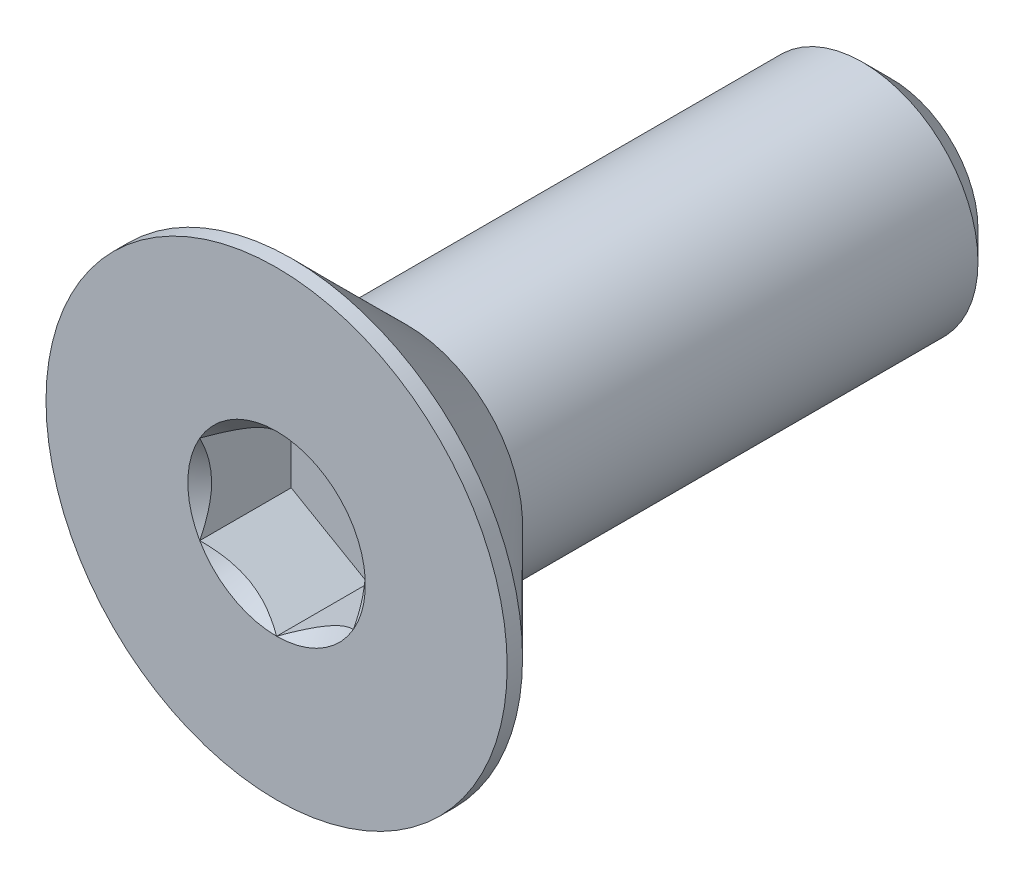
ISO-10303-21;
HEADER;
FILE_DESCRIPTION(('STEP AP214'),'2;1');
FILE_NAME('part.step','',(''),(''),'','','');
FILE_SCHEMA(('AUTOMOTIVE_DESIGN { 1 0 10303 214 1 1 1 1 }'));
ENDSEC;
DATA;
#1=APPLICATION_CONTEXT('core data for automotive mechanical design processes');
#2=APPLICATION_PROTOCOL_DEFINITION('international standard','automotive_design',2000,#1);
#3=PRODUCT_CONTEXT('',#1,'mechanical');
#4=PRODUCT('Part','Part','',(#3));
#5=PRODUCT_RELATED_PRODUCT_CATEGORY('part','',(#4));
#6=PRODUCT_DEFINITION_FORMATION('','',#4);
#7=PRODUCT_DEFINITION_CONTEXT('part definition',#1,'design');
#8=PRODUCT_DEFINITION('design','',#6,#7);
#9=PRODUCT_DEFINITION_SHAPE('','',#8);
#10=(LENGTH_UNIT() NAMED_UNIT(*) SI_UNIT(.MILLI.,.METRE.));
#11=(NAMED_UNIT(*) PLANE_ANGLE_UNIT() SI_UNIT($,.RADIAN.));
#12=(NAMED_UNIT(*) SI_UNIT($,.STERADIAN.) SOLID_ANGLE_UNIT());
#13=UNCERTAINTY_MEASURE_WITH_UNIT(LENGTH_MEASURE(1.E-05),#10,'distance_accuracy_value','');
#14=(GEOMETRIC_REPRESENTATION_CONTEXT(3) GLOBAL_UNCERTAINTY_ASSIGNED_CONTEXT((#13)) GLOBAL_UNIT_ASSIGNED_CONTEXT((#10,
#11,#12)) REPRESENTATION_CONTEXT('',''));
#15=CARTESIAN_POINT('',(0.,0.,0.));
#16=DIRECTION('',(0.,0.,1.));
#17=DIRECTION('',(1.,0.,0.));
#18=AXIS2_PLACEMENT_3D('',#15,#16,#17);
#19=CARTESIAN_POINT('',(1.,-0.577350269189626,-1.19));
#20=DIRECTION('',(0.,0.,1.));
#21=DIRECTION('',(1.,0.,0.));
#22=AXIS2_PLACEMENT_3D('',#19,#20,#21);
#23=PLANE('',#22);
#24=DIRECTION('',(0.,1.,0.));
#25=VECTOR('',#24,1.);
#26=CARTESIAN_POINT('',(-1.,0.577350269189626,-1.19));
#27=LINE('',#26,#25);
#28=CARTESIAN_POINT('',(-0.999999999999999,0.577350269189625,-1.19));
#29=VERTEX_POINT('',#28);
#30=CARTESIAN_POINT('',(-1.,-0.577350269189626,-1.19));
#31=VERTEX_POINT('',#30);
#32=EDGE_CURVE('E83',#29,#31,#27,.F.);
#33=ORIENTED_EDGE('',*,*,#32,.T.);
#34=DIRECTION('',(0.866025403784439,-0.5,0.));
#35=VECTOR('',#34,1.);
#36=CARTESIAN_POINT('',(-1.,-0.577350269189626,-1.19));
#37=LINE('',#36,#35);
#38=CARTESIAN_POINT('',(0.,-1.15470053837925,-1.19));
#39=VERTEX_POINT('',#38);
#40=EDGE_CURVE('E85',#31,#39,#37,.T.);
#41=ORIENTED_EDGE('',*,*,#40,.T.);
#42=DIRECTION('',(0.866025403784439,0.5,0.));
#43=VECTOR('',#42,1.);
#44=CARTESIAN_POINT('',(0.,-1.15470053837925,-1.19));
#45=LINE('',#44,#43);
#46=CARTESIAN_POINT('',(1.,-0.577350269189626,-1.19));
#47=VERTEX_POINT('',#46);
#48=EDGE_CURVE('E86',#39,#47,#45,.T.);
#49=ORIENTED_EDGE('',*,*,#48,.T.);
#50=DIRECTION('',(0.,1.,0.));
#51=VECTOR('',#50,1.);
#52=CARTESIAN_POINT('',(1.,-0.577350269189626,-1.19));
#53=LINE('',#52,#51);
#54=CARTESIAN_POINT('',(1.,0.577350269189626,-1.19));
#55=VERTEX_POINT('',#54);
#56=EDGE_CURVE('E72',#47,#55,#53,.T.);
#57=ORIENTED_EDGE('',*,*,#56,.T.);
#58=DIRECTION('',(-0.866025403784439,0.5,0.));
#59=VECTOR('',#58,1.);
#60=CARTESIAN_POINT('',(1.,0.577350269189626,-1.19));
#61=LINE('',#60,#59);
#62=CARTESIAN_POINT('',(0.,1.15470053837925,-1.19));
#63=VERTEX_POINT('',#62);
#64=EDGE_CURVE('E111',#55,#63,#61,.T.);
#65=ORIENTED_EDGE('',*,*,#64,.T.);
#66=DIRECTION('',(-0.866025403784439,-0.5,0.));
#67=VECTOR('',#66,1.);
#68=CARTESIAN_POINT('',(0.,1.15470053837925,-1.19));
#69=LINE('',#68,#67);
#70=EDGE_CURVE('E116',#63,#29,#69,.T.);
#71=ORIENTED_EDGE('',*,*,#70,.T.);
#72=EDGE_LOOP('',(#33,#41,#49,#57,#65,#71));
#73=FACE_BOUND('',#72,.T.);
#74=ADVANCED_FACE('F17',(#73),#23,.T.);
#75=CARTESIAN_POINT('',(0.,-1.15470053837925,-1.19));
#76=DIRECTION('',(0.5,-0.866025403784439,0.));
#77=DIRECTION('',(0.866025403784439,0.5,0.));
#78=AXIS2_PLACEMENT_3D('',#75,#76,#77);
#79=PLANE('',#78);
#80=CARTESIAN_POINT('',(-3.93149211717141E-11,-1.15470053837926,-9.98108720890825E-11));
#81=CARTESIAN_POINT('',(0.0343705355201057,-1.13485670043636,-0.0198247004221409));
#82=CARTESIAN_POINT('',(0.0693156756519455,-1.11468111438035,-0.0384849664872145));
#83=CARTESIAN_POINT('',(0.140572403035621,-1.07354102364821,-0.0726511232407904));
#84=CARTESIAN_POINT('',(0.176890763106012,-1.05257260868342,-0.0881380101422932));
#85=CARTESIAN_POINT('',(0.250125097696327,-1.01029074589262,-0.11466695978462));
#86=CARTESIAN_POINT('',(0.287022429458596,-0.988988061467716,-0.125775687570534));
#87=CARTESIAN_POINT('',(0.361628600499482,-0.945914168534359,-0.142891513233382));
#88=CARTESIAN_POINT('',(0.399335163701569,-0.924144274119301,-0.148911380305544));
#89=CARTESIAN_POINT('',(0.464327716043936,-0.886620806529054,-0.154341115390247));
#90=CARTESIAN_POINT('',(0.491529304810035,-0.87091596193258,-0.155143433217331));
#91=CARTESIAN_POINT('',(0.545879708710831,-0.839536741609904,-0.153791220399352));
#92=CARTESIAN_POINT('',(0.573028510861522,-0.823862373380022,-0.151636036594819));
#93=CARTESIAN_POINT('',(0.654087027893978,-0.777063216751215,-0.140876680449878));
#94=CARTESIAN_POINT('',(0.707593237347495,-0.746171392319914,-0.127977491939688));
#95=CARTESIAN_POINT('',(0.801462739355952,-0.691975810066637,-0.0968623195341799));
#96=CARTESIAN_POINT('',(0.842267871071583,-0.668416956286299,-0.080283012402365));
#97=CARTESIAN_POINT('',(0.922281198810023,-0.622221239977752,-0.042938715152404));
#98=CARTESIAN_POINT('',(0.961494106307927,-0.599581657278129,-0.0221873504710734));
#99=CARTESIAN_POINT('',(1.00000000003183,-0.577350269171246,-1.09229235933159E-10));
#100=B_SPLINE_CURVE_WITH_KNOTS('',3,(#80,#81,#82,#83,#84,#85,#86,#87,#88,#89,#90,#91,#92,#93,
#94,#95,#96,#97,#98,#99),.UNSPECIFIED.,.F.,.F.,(4,2,2,2,2,2,2,2,2,4),(0.,0.133182946587487,
0.267141541479662,0.398973326833972,0.530473323727982,0.624596460473079,0.718740387507005,
0.907081600610891,1.05673041335255,1.20589820631879),.UNSPECIFIED.);
#101=CARTESIAN_POINT('',(0.,-1.15470053839843,-1.08428119008629E-10));
#102=VERTEX_POINT('',#101);
#103=CARTESIAN_POINT('',(1.00000000001661,-0.577350269199215,-1.08427881602401E-10));
#104=VERTEX_POINT('',#103);
#105=EDGE_CURVE('E20',#102,#104,#100,.T.);
#106=ORIENTED_EDGE('',*,*,#105,.T.);
#107=DIRECTION('',(0.,0.,-1.));
#108=VECTOR('',#107,1.);
#109=CARTESIAN_POINT('',(1.,-0.577350269189626,-1.19));
#110=LINE('',#109,#108);
#111=EDGE_CURVE('E91',#104,#47,#110,.T.);
#112=ORIENTED_EDGE('',*,*,#111,.T.);
#113=ORIENTED_EDGE('',*,*,#48,.F.);
#114=DIRECTION('',(0.,0.,1.));
#115=VECTOR('',#114,1.);
#116=CARTESIAN_POINT('',(0.,-1.15470053837925,-1.19));
#117=LINE('',#116,#115);
#118=EDGE_CURVE('E59',#39,#102,#117,.T.);
#119=ORIENTED_EDGE('',*,*,#118,.T.);
#120=EDGE_LOOP('',(#106,#112,#113,#119));
#121=FACE_BOUND('',#120,.T.);
#122=ADVANCED_FACE('F90',(#121),#79,.F.);
#123=CARTESIAN_POINT('',(-1.,-0.577350269189626,-1.19));
#124=DIRECTION('',(-0.5,-0.866025403784439,0.));
#125=DIRECTION('',(0.866025403784439,-0.5,0.));
#126=AXIS2_PLACEMENT_3D('',#123,#124,#125);
#127=PLANE('',#126);
#128=CARTESIAN_POINT('',(-1.00000000001966,-0.577350269155583,-9.98096224744557E-11));
#129=CARTESIAN_POINT('',(-0.965629464472823,-0.597194107120269,-0.0198247004221396));
#130=CARTESIAN_POINT('',(-0.930684324346155,-0.617369693185242,-0.0384849664872131));
#131=CARTESIAN_POINT('',(-0.859427596966287,-0.658509783923978,-0.0726511232407891));
#132=CARTESIAN_POINT('',(-0.823109236894494,-0.679478198886334,-0.0881380101422919));
#133=CARTESIAN_POINT('',(-0.749874902303172,-0.721760061675394,-0.114666959784619));
#134=CARTESIAN_POINT('',(-0.71297757054127,-0.743062746100931,-0.125775687570532));
#135=CARTESIAN_POINT('',(-0.638371399500649,-0.786136639034746,-0.14289151323338));
#136=CARTESIAN_POINT('',(-0.600664836298461,-0.807906533449627,-0.148911380305542));
#137=CARTESIAN_POINT('',(-0.535672283956042,-0.845430001039785,-0.154341115390246));
#138=CARTESIAN_POINT('',(-0.508470695189959,-0.861134845636286,-0.155143433217329));
#139=CARTESIAN_POINT('',(-0.454120291289175,-0.892514065958982,-0.15379122039935));
#140=CARTESIAN_POINT('',(-0.426971489138479,-0.908188434188858,-0.151636036594817));
#141=CARTESIAN_POINT('',(-0.345912972106017,-0.954987590817655,-0.140876680449876));
#142=CARTESIAN_POINT('',(-0.292406762652503,-0.985879415248961,-0.127977491939686));
#143=CARTESIAN_POINT('',(-0.198537260644048,-1.04007499750224,-0.0968623195341786));
#144=CARTESIAN_POINT('',(-0.157732128928417,-1.06363385128258,-0.0802830124023638));
#145=CARTESIAN_POINT('',(-0.0777188011899764,-1.10982956759112,-0.0429387151524029));
#146=CARTESIAN_POINT('',(-0.0385058936920724,-1.13246915029075,-0.0221873504710723));
#147=CARTESIAN_POINT('',(3.18328951443562E-11,-1.15470053839763,-1.09228385770901E-10));
#148=B_SPLINE_CURVE_WITH_KNOTS('',3,(#128,#129,#130,#131,#132,#133,#134,#135,#136,#137,#138,
#139,#140,#141,#142,#143,#144,#145,#146,#147),.UNSPECIFIED.,.F.,.F.,(4,2,2,2,2,2,2,2,2,4),(0.,
0.133182946587487,0.267141541479662,0.398973326833972,0.530473323727981,0.624596460473079,
0.718740387507004,0.907081600610891,1.05673041335255,1.20589820631879),.UNSPECIFIED.);
#149=CARTESIAN_POINT('',(-1.00000000001661,-0.577350269199216,-1.08427372625039E-10));
#150=VERTEX_POINT('',#149);
#151=EDGE_CURVE('E95',#150,#102,#148,.T.);
#152=ORIENTED_EDGE('',*,*,#151,.T.);
#153=ORIENTED_EDGE('',*,*,#118,.F.);
#154=ORIENTED_EDGE('',*,*,#40,.F.);
#155=DIRECTION('',(0.,0.,1.));
#156=VECTOR('',#155,1.);
#157=CARTESIAN_POINT('',(-1.,-0.577350269189626,-1.19));
#158=LINE('',#157,#156);
#159=EDGE_CURVE('E97',#31,#150,#158,.T.);
#160=ORIENTED_EDGE('',*,*,#159,.T.);
#161=EDGE_LOOP('',(#152,#153,#154,#160));
#162=FACE_BOUND('',#161,.T.);
#163=ADVANCED_FACE('F93',(#162),#127,.F.);
#164=CARTESIAN_POINT('',(-1.,0.577350269189626,-1.19));
#165=DIRECTION('',(-1.,0.,0.));
#166=DIRECTION('',(0.,0.,1.));
#167=AXIS2_PLACEMENT_3D('',#164,#165,#166);
#168=PLANE('',#167);
#169=CARTESIAN_POINT('',(-0.999999999980349,0.577350269223676,-9.98097322622048E-11));
#170=CARTESIAN_POINT('',(-0.999999999992929,0.537662593316093,-0.0198247004221396));
#171=CARTESIAN_POINT('',(-0.999999999998101,0.497311421195105,-0.0384849664872131));
#172=CARTESIAN_POINT('',(-1.00000000000191,0.41503123972423,-0.0726511232407892));
#173=CARTESIAN_POINT('',(-1.00000000000051,0.373094409797089,-0.0881380101422921));
#174=CARTESIAN_POINT('',(-0.999999999999501,0.288530684217224,-0.114666959784619));
#175=CARTESIAN_POINT('',(-0.999999999999868,0.245925315366786,-0.125775687570532));
#176=CARTESIAN_POINT('',(-1.00000000000013,0.159777529499614,-0.142891513233381));
#177=CARTESIAN_POINT('',(-1.00000000000003,0.116237740669674,-0.148911380305542));
#178=CARTESIAN_POINT('',(-0.999999999999979,0.0411908054892712,-0.154341115390246));
#179=CARTESIAN_POINT('',(-0.999999999999994,0.00978111629629506,-0.155143433217329));
#180=CARTESIAN_POINT('',(-1.00000000000001,-0.0529773243490767,-0.15379122039935));
#181=CARTESIAN_POINT('',(-1.,-0.0843260608088347,-0.151636036594817));
#182=CARTESIAN_POINT('',(-0.999999999999996,-0.177924374066439,-0.140876680449876));
#183=CARTESIAN_POINT('',(-0.999999999999999,-0.239708022929046,-0.127977491939686));
#184=CARTESIAN_POINT('',(-1.,-0.348099187435602,-0.0968623195341786));
#185=CARTESIAN_POINT('',(-1.,-0.395216894996278,-0.0802830124023637));
#186=CARTESIAN_POINT('',(-1.,-0.48760832761337,-0.0429387151524027));
#187=CARTESIAN_POINT('',(-0.999999999999999,-0.532887493012616,-0.0221873504710721));
#188=CARTESIAN_POINT('',(-1.,-0.577350269226384,-1.09228152961273E-10));
#189=B_SPLINE_CURVE_WITH_KNOTS('',3,(#169,#170,#171,#172,#173,#174,#175,#176,#177,#178,#179,
#180,#181,#182,#183,#184,#185,#186,#187,#188),.UNSPECIFIED.,.F.,.F.,(4,2,2,2,2,2,2,2,2,4),(0.,
0.133182946587487,0.267141541479662,0.398973326833972,0.530473323727981,0.624596460473079,
0.718740387507004,0.907081600610891,1.05673041335255,1.20589820631879),.UNSPECIFIED.);
#190=CARTESIAN_POINT('',(-1.00000000001661,0.577350269199215,-1.08428018983097E-10));
#191=VERTEX_POINT('',#190);
#192=EDGE_CURVE('E195',#191,#150,#189,.T.);
#193=ORIENTED_EDGE('',*,*,#192,.T.);
#194=ORIENTED_EDGE('',*,*,#159,.F.);
#195=ORIENTED_EDGE('',*,*,#32,.F.);
#196=DIRECTION('',(0.,0.,1.));
#197=VECTOR('',#196,1.);
#198=CARTESIAN_POINT('',(-0.999999999999999,0.577350269189625,-1.19));
#199=LINE('',#198,#197);
#200=EDGE_CURVE('E113',#29,#191,#199,.T.);
#201=ORIENTED_EDGE('',*,*,#200,.T.);
#202=EDGE_LOOP('',(#193,#194,#195,#201));
#203=FACE_BOUND('',#202,.T.);
#204=ADVANCED_FACE('F205',(#203),#168,.F.);
#205=CARTESIAN_POINT('',(0.,1.15470053837925,-1.19));
#206=DIRECTION('',(-0.5,0.866025403784439,0.));
#207=DIRECTION('',(-0.866025403784439,-0.5,0.));
#208=AXIS2_PLACEMENT_3D('',#205,#206,#207);
#209=PLANE('',#208);
#210=CARTESIAN_POINT('',(3.93151612738882E-11,1.15470053837926,-9.98107731299659E-11));
#211=CARTESIAN_POINT('',(-0.0343705355201053,1.13485670043636,-0.0198247004221408));
#212=CARTESIAN_POINT('',(-0.0693156756519452,1.11468111438035,-0.0384849664872144));
#213=CARTESIAN_POINT('',(-0.140572403035621,1.07354102364821,-0.0726511232407903));
#214=CARTESIAN_POINT('',(-0.176890763106012,1.05257260868342,-0.0881380101422931));
#215=CARTESIAN_POINT('',(-0.250125097696327,1.01029074589262,-0.11466695978462));
#216=CARTESIAN_POINT('',(-0.287022429458596,0.988988061467716,-0.125775687570534));
#217=CARTESIAN_POINT('',(-0.361628600499482,0.945914168534359,-0.142891513233382));
#218=CARTESIAN_POINT('',(-0.399335163701568,0.924144274119301,-0.148911380305543));
#219=CARTESIAN_POINT('',(-0.464327716043936,0.886620806529055,-0.154341115390247));
#220=CARTESIAN_POINT('',(-0.491529304810035,0.87091596193258,-0.155143433217331));
#221=CARTESIAN_POINT('',(-0.54587970871083,0.839536741609904,-0.153791220399352));
#222=CARTESIAN_POINT('',(-0.573028510861522,0.823862373380022,-0.151636036594819));
#223=CARTESIAN_POINT('',(-0.654087027893978,0.777063216751215,-0.140876680449878));
#224=CARTESIAN_POINT('',(-0.707593237347495,0.746171392319914,-0.127977491939688));
#225=CARTESIAN_POINT('',(-0.801462739355952,0.691975810066637,-0.0968623195341798));
#226=CARTESIAN_POINT('',(-0.842267871071583,0.668416956286299,-0.0802830124023649));
#227=CARTESIAN_POINT('',(-0.922281198810023,0.622221239977752,-0.0429387151524038));
#228=CARTESIAN_POINT('',(-0.961494106307926,0.599581657278129,-0.0221873504710732));
#229=CARTESIAN_POINT('',(-1.00000000003183,0.577350269171245,-1.09229129721644E-10));
#230=B_SPLINE_CURVE_WITH_KNOTS('',3,(#210,#211,#212,#213,#214,#215,#216,#217,#218,#219,#220,
#221,#222,#223,#224,#225,#226,#227,#228,#229),.UNSPECIFIED.,.F.,.F.,(4,2,2,2,2,2,2,2,2,4),(0.,
0.133182946587487,0.267141541479662,0.398973326833972,0.530473323727982,0.624596460473079,
0.718740387507005,0.907081600610891,1.05673041335255,1.20589820631879),.UNSPECIFIED.);
#231=CARTESIAN_POINT('',(0.,1.15470053839843,-1.08428126061562E-10));
#232=VERTEX_POINT('',#231);
#233=EDGE_CURVE('E187',#232,#191,#230,.T.);
#234=ORIENTED_EDGE('',*,*,#233,.T.);
#235=ORIENTED_EDGE('',*,*,#200,.F.);
#236=ORIENTED_EDGE('',*,*,#70,.F.);
#237=DIRECTION('',(0.,0.,1.));
#238=VECTOR('',#237,1.);
#239=CARTESIAN_POINT('',(0.,1.15470053837925,-1.19));
#240=LINE('',#239,#238);
#241=EDGE_CURVE('E108',#63,#232,#240,.T.);
#242=ORIENTED_EDGE('',*,*,#241,.T.);
#243=EDGE_LOOP('',(#234,#235,#236,#242));
#244=FACE_BOUND('',#243,.T.);
#245=ADVANCED_FACE('F201',(#244),#209,.F.);
#246=CARTESIAN_POINT('',(1.,0.577350269189626,-1.19));
#247=DIRECTION('',(0.5,0.866025403784439,0.));
#248=DIRECTION('',(-0.866025403784439,0.5,0.));
#249=AXIS2_PLACEMENT_3D('',#246,#247,#248);
#250=PLANE('',#249);
#251=CARTESIAN_POINT('',(1.00000000001966,0.577350269155583,-9.98095479908323E-11));
#252=CARTESIAN_POINT('',(0.965629464472823,0.597194107120269,-0.0198247004221397));
#253=CARTESIAN_POINT('',(0.930684324346155,0.617369693185242,-0.0384849664872132));
#254=CARTESIAN_POINT('',(0.859427596966287,0.658509783923978,-0.0726511232407891));
#255=CARTESIAN_POINT('',(0.823109236894494,0.679478198886334,-0.0881380101422918));
#256=CARTESIAN_POINT('',(0.749874902303172,0.721760061675394,-0.114666959784619));
#257=CARTESIAN_POINT('',(0.712977570541271,0.743062746100931,-0.125775687570532));
#258=CARTESIAN_POINT('',(0.638371399500649,0.786136639034746,-0.142891513233381));
#259=CARTESIAN_POINT('',(0.600664836298461,0.807906533449627,-0.148911380305542));
#260=CARTESIAN_POINT('',(0.535672283956042,0.845430001039784,-0.154341115390246));
#261=CARTESIAN_POINT('',(0.508470695189959,0.861134845636286,-0.155143433217329));
#262=CARTESIAN_POINT('',(0.454120291289175,0.892514065958982,-0.15379122039935));
#263=CARTESIAN_POINT('',(0.426971489138479,0.908188434188858,-0.151636036594817));
#264=CARTESIAN_POINT('',(0.345912972106017,0.954987590817654,-0.140876680449876));
#265=CARTESIAN_POINT('',(0.292406762652503,0.985879415248961,-0.127977491939686));
#266=CARTESIAN_POINT('',(0.198537260644048,1.04007499750224,-0.0968623195341785));
#267=CARTESIAN_POINT('',(0.157732128928417,1.06363385128258,-0.0802830124023638));
#268=CARTESIAN_POINT('',(0.0777188011899766,1.10982956759112,-0.042938715152403));
#269=CARTESIAN_POINT('',(0.0385058936920726,1.13246915029075,-0.0221873504710725));
#270=CARTESIAN_POINT('',(-3.18326351011692E-11,1.15470053839763,-1.0922858632033E-10));
#271=B_SPLINE_CURVE_WITH_KNOTS('',3,(#251,#252,#253,#254,#255,#256,#257,#258,#259,#260,#261,
#262,#263,#264,#265,#266,#267,#268,#269,#270),.UNSPECIFIED.,.F.,.F.,(4,2,2,2,2,2,2,2,2,4),(0.,
0.133182946587487,0.267141541479662,0.398973326833972,0.530473323727981,0.624596460473079,
0.718740387507004,0.907081600610891,1.05673041335255,1.20589820631879),.UNSPECIFIED.);
#272=CARTESIAN_POINT('',(1.00000000001661,0.577350269199216,-1.08427368067908E-10));
#273=VERTEX_POINT('',#272);
#274=EDGE_CURVE('E157',#273,#232,#271,.T.);
#275=ORIENTED_EDGE('',*,*,#274,.T.);
#276=ORIENTED_EDGE('',*,*,#241,.F.);
#277=ORIENTED_EDGE('',*,*,#64,.F.);
#278=DIRECTION('',(0.,0.,-1.));
#279=VECTOR('',#278,1.);
#280=CARTESIAN_POINT('',(1.,0.577350269189626,-1.19));
#281=LINE('',#280,#279);
#282=EDGE_CURVE('E40',#55,#273,#281,.F.);
#283=ORIENTED_EDGE('',*,*,#282,.T.);
#284=EDGE_LOOP('',(#275,#276,#277,#283));
#285=FACE_BOUND('',#284,.T.);
#286=ADVANCED_FACE('F204',(#285),#250,.F.);
#287=CARTESIAN_POINT('',(1.,-0.577350269189626,-1.19));
#288=DIRECTION('',(1.,0.,0.));
#289=DIRECTION('',(0.,0.,-1.));
#290=AXIS2_PLACEMENT_3D('',#287,#288,#289);
#291=PLANE('',#290);
#292=CARTESIAN_POINT('',(0.999999999980349,-0.577350269223676,-9.9809589808285E-11));
#293=CARTESIAN_POINT('',(0.999999999992929,-0.537662593316093,-0.0198247004221397));
#294=CARTESIAN_POINT('',(0.999999999998101,-0.497311421195106,-0.0384849664872132));
#295=CARTESIAN_POINT('',(1.00000000000191,-0.41503123972423,-0.0726511232407891));
#296=CARTESIAN_POINT('',(1.00000000000051,-0.373094409797089,-0.0881380101422919));
#297=CARTESIAN_POINT('',(0.999999999999501,-0.288530684217224,-0.114666959784619));
#298=CARTESIAN_POINT('',(0.999999999999868,-0.245925315366786,-0.125775687570532));
#299=CARTESIAN_POINT('',(1.00000000000013,-0.159777529499614,-0.142891513233381));
#300=CARTESIAN_POINT('',(1.00000000000003,-0.116237740669675,-0.148911380305542));
#301=CARTESIAN_POINT('',(0.999999999999979,-0.0411908054892712,-0.154341115390246));
#302=CARTESIAN_POINT('',(0.999999999999994,-0.00978111629629504,-0.155143433217329));
#303=CARTESIAN_POINT('',(1.00000000000001,0.0529773243490767,-0.15379122039935));
#304=CARTESIAN_POINT('',(1.,0.0843260608088348,-0.151636036594817));
#305=CARTESIAN_POINT('',(0.999999999999996,0.177924374066439,-0.140876680449876));
#306=CARTESIAN_POINT('',(0.999999999999999,0.239708022929046,-0.127977491939686));
#307=CARTESIAN_POINT('',(1.,0.348099187435602,-0.0968623195341786));
#308=CARTESIAN_POINT('',(1.,0.395216894996278,-0.0802830124023637));
#309=CARTESIAN_POINT('',(1.,0.48760832761337,-0.0429387151524027));
#310=CARTESIAN_POINT('',(0.999999999999999,0.532887493012615,-0.0221873504710721));
#311=CARTESIAN_POINT('',(1.,0.577350269226384,-1.09228176785756E-10));
#312=B_SPLINE_CURVE_WITH_KNOTS('',3,(#292,#293,#294,#295,#296,#297,#298,#299,#300,#301,#302,
#303,#304,#305,#306,#307,#308,#309,#310,#311),.UNSPECIFIED.,.F.,.F.,(4,2,2,2,2,2,2,2,2,4),(0.,
0.133182946587487,0.267141541479662,0.398973326833972,0.530473323727982,0.624596460473079,
0.718740387507005,0.907081600610891,1.05673041335255,1.20589820631879),.UNSPECIFIED.);
#313=EDGE_CURVE('E149',#104,#273,#312,.T.);
#314=ORIENTED_EDGE('',*,*,#313,.T.);
#315=ORIENTED_EDGE('',*,*,#282,.F.);
#316=ORIENTED_EDGE('',*,*,#56,.F.);
#317=ORIENTED_EDGE('',*,*,#111,.F.);
#318=EDGE_LOOP('',(#314,#315,#316,#317));
#319=FACE_BOUND('',#318,.T.);
#320=ADVANCED_FACE('F165',(#319),#291,.F.);
#321=CARTESIAN_POINT('',(0.,0.,-1.70530256582424E-10));
#322=DIRECTION('',(0.,0.,1.));
#323=DIRECTION('',(1.,0.,0.));
#324=AXIS2_PLACEMENT_3D('',#321,#322,#323);
#325=CONICAL_SURFACE('',#324,1.15470053833633,0.785398163397448);
#326=ORIENTED_EDGE('',*,*,#105,.F.);
#327=CARTESIAN_POINT('',(0.,0.,-1.13686837721616E-10));
#328=DIRECTION('',(0.,0.,1.));
#329=DIRECTION('',(1.,0.,0.));
#330=AXIS2_PLACEMENT_3D('',#327,#328,#329);
#331=CIRCLE('',#330,1.15470053839317);
#332=EDGE_CURVE('E146',#104,#102,#331,.F.);
#333=ORIENTED_EDGE('',*,*,#332,.F.);
#334=EDGE_LOOP('',(#326,#333));
#335=FACE_BOUND('',#334,.T.);
#336=ADVANCED_FACE('F222',(#335),#325,.F.);
#337=CARTESIAN_POINT('',(0.,0.,-1.70530256582424E-10));
#338=DIRECTION('',(0.,0.,1.));
#339=DIRECTION('',(1.,0.,0.));
#340=AXIS2_PLACEMENT_3D('',#337,#338,#339);
#341=CONICAL_SURFACE('',#340,1.15470053833633,0.785398163397448);
#342=ORIENTED_EDGE('',*,*,#151,.F.);
#343=CARTESIAN_POINT('',(0.,0.,-1.13686837721616E-10));
#344=DIRECTION('',(0.,0.,1.));
#345=DIRECTION('',(1.,0.,0.));
#346=AXIS2_PLACEMENT_3D('',#343,#344,#345);
#347=CIRCLE('',#346,1.15470053839317);
#348=EDGE_CURVE('E143',#102,#150,#347,.F.);
#349=ORIENTED_EDGE('',*,*,#348,.F.);
#350=EDGE_LOOP('',(#342,#349));
#351=FACE_BOUND('',#350,.T.);
#352=ADVANCED_FACE('F219',(#351),#341,.F.);
#353=CARTESIAN_POINT('',(0.,0.,-1.70530256582424E-10));
#354=DIRECTION('',(0.,0.,1.));
#355=DIRECTION('',(1.,0.,0.));
#356=AXIS2_PLACEMENT_3D('',#353,#354,#355);
#357=CONICAL_SURFACE('',#356,1.15470053833633,0.785398163397448);
#358=ORIENTED_EDGE('',*,*,#192,.F.);
#359=CARTESIAN_POINT('',(0.,0.,-1.13686837721616E-10));
#360=DIRECTION('',(0.,0.,1.));
#361=DIRECTION('',(1.,0.,0.));
#362=AXIS2_PLACEMENT_3D('',#359,#360,#361);
#363=CIRCLE('',#362,1.15470053839317);
#364=EDGE_CURVE('E140',#150,#191,#363,.F.);
#365=ORIENTED_EDGE('',*,*,#364,.F.);
#366=EDGE_LOOP('',(#358,#365));
#367=FACE_BOUND('',#366,.T.);
#368=ADVANCED_FACE('F183',(#367),#357,.F.);
#369=CARTESIAN_POINT('',(0.,0.,-1.70530256582424E-10));
#370=DIRECTION('',(0.,0.,1.));
#371=DIRECTION('',(1.,0.,0.));
#372=AXIS2_PLACEMENT_3D('',#369,#370,#371);
#373=CONICAL_SURFACE('',#372,1.15470053833633,0.785398163397448);
#374=ORIENTED_EDGE('',*,*,#233,.F.);
#375=CARTESIAN_POINT('',(0.,0.,-1.13686837721616E-10));
#376=DIRECTION('',(0.,0.,1.));
#377=DIRECTION('',(1.,0.,0.));
#378=AXIS2_PLACEMENT_3D('',#375,#376,#377);
#379=CIRCLE('',#378,1.15470053839317);
#380=EDGE_CURVE('E137',#191,#232,#379,.F.);
#381=ORIENTED_EDGE('',*,*,#380,.F.);
#382=EDGE_LOOP('',(#374,#381));
#383=FACE_BOUND('',#382,.T.);
#384=ADVANCED_FACE('F178',(#383),#373,.F.);
#385=CARTESIAN_POINT('',(0.,0.,-1.70530256582424E-10));
#386=DIRECTION('',(0.,0.,1.));
#387=DIRECTION('',(1.,0.,0.));
#388=AXIS2_PLACEMENT_3D('',#385,#386,#387);
#389=CONICAL_SURFACE('',#388,1.15470053833633,0.785398163397448);
#390=ORIENTED_EDGE('',*,*,#274,.F.);
#391=CARTESIAN_POINT('',(0.,0.,-1.13686837721616E-10));
#392=DIRECTION('',(0.,0.,1.));
#393=DIRECTION('',(1.,0.,0.));
#394=AXIS2_PLACEMENT_3D('',#391,#392,#393);
#395=CIRCLE('',#394,1.15470053839317);
#396=EDGE_CURVE('E134',#232,#273,#395,.F.);
#397=ORIENTED_EDGE('',*,*,#396,.F.);
#398=EDGE_LOOP('',(#390,#397));
#399=FACE_BOUND('',#398,.T.);
#400=ADVANCED_FACE('F172',(#399),#389,.F.);
#401=CARTESIAN_POINT('',(0.,0.,-1.70530256582424E-10));
#402=DIRECTION('',(0.,0.,1.));
#403=DIRECTION('',(1.,0.,0.));
#404=AXIS2_PLACEMENT_3D('',#401,#402,#403);
#405=CONICAL_SURFACE('',#404,1.15470053833633,0.785398163397448);
#406=CARTESIAN_POINT('',(0.,0.,-1.13686837721616E-10));
#407=DIRECTION('',(0.,0.,1.));
#408=DIRECTION('',(1.,0.,0.));
#409=AXIS2_PLACEMENT_3D('',#406,#407,#408);
#410=CIRCLE('',#409,1.15470053839317);
#411=EDGE_CURVE('E131',#273,#104,#410,.F.);
#412=ORIENTED_EDGE('',*,*,#411,.F.);
#413=ORIENTED_EDGE('',*,*,#313,.F.);
#414=EDGE_LOOP('',(#412,#413));
#415=FACE_BOUND('',#414,.T.);
#416=ADVANCED_FACE('F167',(#415),#405,.F.);
#417=CARTESIAN_POINT('',(0.,-1.5,0.));
#418=DIRECTION('',(0.,0.,1.));
#419=DIRECTION('',(0.,-1.,0.));
#420=AXIS2_PLACEMENT_3D('',#417,#418,#419);
#421=PLANE('',#420);
#422=ORIENTED_EDGE('',*,*,#396,.T.);
#423=ORIENTED_EDGE('',*,*,#411,.T.);
#424=ORIENTED_EDGE('',*,*,#332,.T.);
#425=ORIENTED_EDGE('',*,*,#348,.T.);
#426=ORIENTED_EDGE('',*,*,#364,.T.);
#427=ORIENTED_EDGE('',*,*,#380,.T.);
#428=EDGE_LOOP('',(#422,#423,#424,#425,#426,#427));
#429=FACE_BOUND('',#428,.T.);
#430=CARTESIAN_POINT('',(0.,0.,0.));
#431=DIRECTION('',(0.,0.,1.));
#432=DIRECTION('',(0.,-1.,0.));
#433=AXIS2_PLACEMENT_3D('',#430,#431,#432);
#434=CIRCLE('',#433,3.);
#435=CARTESIAN_POINT('',(0.,-3.,0.));
#436=VERTEX_POINT('',#435);
#437=EDGE_CURVE('E128',#436,#436,#434,.F.);
#438=ORIENTED_EDGE('',*,*,#437,.F.);
#439=EDGE_LOOP('',(#438));
#440=FACE_BOUND('',#439,.T.);
#441=ADVANCED_FACE('F171',(#429,#440),#421,.T.);
#442=CARTESIAN_POINT('',(0.,-1.5,-8.));
#443=DIRECTION('',(0.,0.,-1.));
#444=DIRECTION('',(0.,1.,0.));
#445=AXIS2_PLACEMENT_3D('',#442,#443,#444);
#446=PLANE('',#445);
#447=CARTESIAN_POINT('',(0.,0.,-8.00000000015189));
#448=DIRECTION('',(0.,0.,1.));
#449=DIRECTION('',(1.,0.,0.));
#450=AXIS2_PLACEMENT_3D('',#447,#448,#449);
#451=CIRCLE('',#450,1.12499999983129);
#452=CARTESIAN_POINT('',(1.12499999983129,0.,-8.00000000015189));
#453=VERTEX_POINT('',#452);
#454=EDGE_CURVE('E124',#453,#453,#451,.T.);
#455=ORIENTED_EDGE('',*,*,#454,.F.);
#456=EDGE_LOOP('',(#455));
#457=FACE_BOUND('',#456,.T.);
#458=ADVANCED_FACE('F250',(#457),#446,.T.);
#459=CARTESIAN_POINT('',(0.,0.,0.));
#460=DIRECTION('',(0.,0.,1.));
#461=DIRECTION('',(0.,-1.,0.));
#462=AXIS2_PLACEMENT_3D('',#459,#460,#461);
#463=CYLINDRICAL_SURFACE('',#462,3.);
#464=CARTESIAN_POINT('',(0.,0.,-0.200000000006641));
#465=DIRECTION('',(0.,0.,1.));
#466=DIRECTION('',(0.,-1.,0.));
#467=AXIS2_PLACEMENT_3D('',#464,#465,#466);
#468=CIRCLE('',#467,3.00000000004275);
#469=CARTESIAN_POINT('',(0.,-3.00000000004275,-0.200000000006639));
#470=VERTEX_POINT('',#469);
#471=EDGE_CURVE('E127',#470,#470,#468,.F.);
#472=ORIENTED_EDGE('',*,*,#471,.F.);
#473=EDGE_LOOP('',(#472));
#474=FACE_BOUND('',#473,.T.);
#475=ORIENTED_EDGE('',*,*,#437,.T.);
#476=EDGE_LOOP('',(#475));
#477=FACE_BOUND('',#476,.T.);
#478=ADVANCED_FACE('F247',(#474,#477),#463,.T.);
#479=CARTESIAN_POINT('',(0.,0.,-7.6249999999618));
#480=DIRECTION('',(0.,0.,1.));
#481=DIRECTION('',(1.,0.,0.));
#482=AXIS2_PLACEMENT_3D('',#479,#480,#481);
#483=CONICAL_SURFACE('',#482,1.50000000002137,0.785398163397448);
#484=ORIENTED_EDGE('',*,*,#454,.T.);
#485=EDGE_LOOP('',(#484));
#486=FACE_BOUND('',#485,.T.);
#487=CARTESIAN_POINT('',(0.,0.,-7.625));
#488=DIRECTION('',(0.,0.,-1.));
#489=DIRECTION('',(0.,1.,0.));
#490=AXIS2_PLACEMENT_3D('',#487,#488,#489);
#491=CIRCLE('',#490,1.5);
#492=CARTESIAN_POINT('',(0.,1.5,-7.625));
#493=VERTEX_POINT('',#492);
#494=EDGE_CURVE('E31',#493,#493,#491,.F.);
#495=ORIENTED_EDGE('',*,*,#494,.F.);
#496=EDGE_LOOP('',(#495));
#497=FACE_BOUND('',#496,.T.);
#498=ADVANCED_FACE('F240',(#486,#497),#483,.T.);
#499=CARTESIAN_POINT('',(0.,0.,-0.200000000177172));
#500=DIRECTION('',(0.,0.,1.));
#501=DIRECTION('',(0.,-1.,0.));
#502=AXIS2_PLACEMENT_3D('',#499,#500,#501);
#503=CONICAL_SURFACE('',#502,2.99999999987222,0.785398163397449);
#504=CARTESIAN_POINT('',(0.,0.,-1.7));
#505=DIRECTION('',(0.,0.,-1.));
#506=DIRECTION('',(0.,1.,0.));
#507=AXIS2_PLACEMENT_3D('',#504,#505,#506);
#508=CIRCLE('',#507,1.5);
#509=CARTESIAN_POINT('',(0.,1.5,-1.7));
#510=VERTEX_POINT('',#509);
#511=EDGE_CURVE('E11',#510,#510,#508,.T.);
#512=ORIENTED_EDGE('',*,*,#511,.F.);
#513=EDGE_LOOP('',(#512));
#514=FACE_BOUND('',#513,.T.);
#515=ORIENTED_EDGE('',*,*,#471,.T.);
#516=EDGE_LOOP('',(#515));
#517=FACE_BOUND('',#516,.T.);
#518=ADVANCED_FACE('F234',(#514,#517),#503,.T.);
#519=CARTESIAN_POINT('',(0.,0.,-8.));
#520=DIRECTION('',(0.,0.,-1.));
#521=DIRECTION('',(0.,1.,0.));
#522=AXIS2_PLACEMENT_3D('',#519,#520,#521);
#523=CYLINDRICAL_SURFACE('',#522,1.5);
#524=ORIENTED_EDGE('',*,*,#511,.T.);
#525=EDGE_LOOP('',(#524));
#526=FACE_BOUND('',#525,.T.);
#527=ORIENTED_EDGE('',*,*,#494,.T.);
#528=EDGE_LOOP('',(#527));
#529=FACE_BOUND('',#528,.T.);
#530=ADVANCED_FACE('F232',(#526,#529),#523,.T.);
#531=CLOSED_SHELL('',(#74,#122,#163,#204,#245,#286,#320,#336,#352,#368,#384,#400,#416,#441,#458,
#478,#498,#518,#530));
#532=MANIFOLD_SOLID_BREP('B1',#531);
#533=ADVANCED_BREP_SHAPE_REPRESENTATION('',(#18,#532),#14);
#534=SHAPE_DEFINITION_REPRESENTATION(#9,#533);
ENDSEC;
END-ISO-10303-21;
